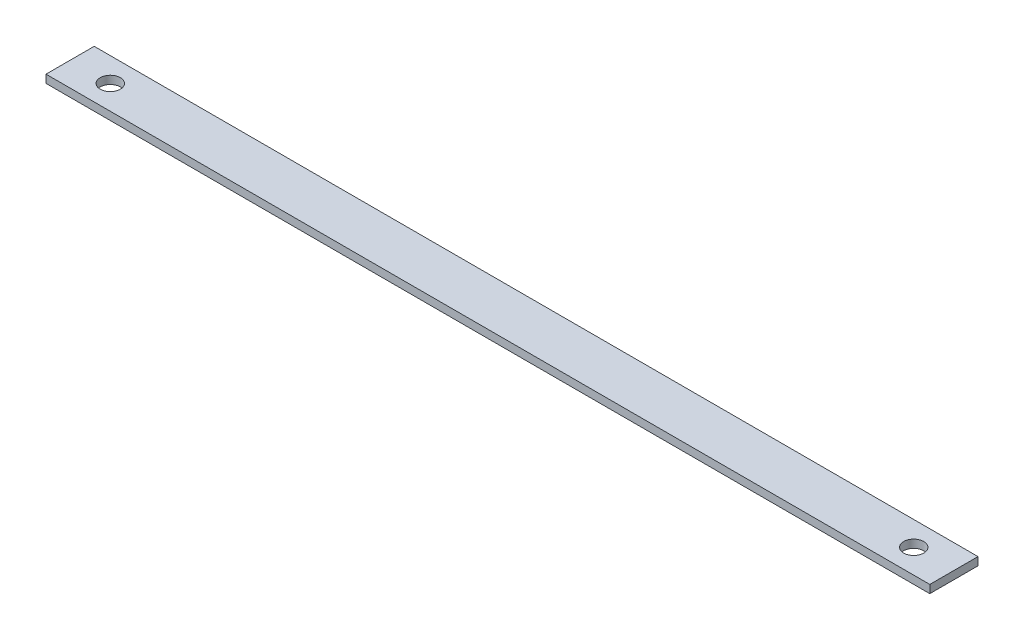
ISO-10303-21;
HEADER;
FILE_DESCRIPTION(('STEP AP214'),'2;1');
FILE_NAME('part.step','',(''),(''),'','','');
FILE_SCHEMA(('AUTOMOTIVE_DESIGN { 1 0 10303 214 1 1 1 1 }'));
ENDSEC;
DATA;
#1=APPLICATION_CONTEXT('core data for automotive mechanical design processes');
#2=APPLICATION_PROTOCOL_DEFINITION('international standard','automotive_design',2000,#1);
#3=PRODUCT_CONTEXT('',#1,'mechanical');
#4=PRODUCT('Part','Part','',(#3));
#5=PRODUCT_RELATED_PRODUCT_CATEGORY('part','',(#4));
#6=PRODUCT_DEFINITION_FORMATION('','',#4);
#7=PRODUCT_DEFINITION_CONTEXT('part definition',#1,'design');
#8=PRODUCT_DEFINITION('design','',#6,#7);
#9=PRODUCT_DEFINITION_SHAPE('','',#8);
#10=(LENGTH_UNIT() NAMED_UNIT(*) SI_UNIT(.MILLI.,.METRE.));
#11=(NAMED_UNIT(*) PLANE_ANGLE_UNIT() SI_UNIT($,.RADIAN.));
#12=(NAMED_UNIT(*) SI_UNIT($,.STERADIAN.) SOLID_ANGLE_UNIT());
#13=UNCERTAINTY_MEASURE_WITH_UNIT(LENGTH_MEASURE(1.E-05),#10,'distance_accuracy_value','');
#14=(GEOMETRIC_REPRESENTATION_CONTEXT(3) GLOBAL_UNCERTAINTY_ASSIGNED_CONTEXT((#13)) GLOBAL_UNIT_ASSIGNED_CONTEXT((#10,
#11,#12)) REPRESENTATION_CONTEXT('',''));
#15=CARTESIAN_POINT('',(0.,0.,0.));
#16=DIRECTION('',(0.,0.,1.));
#17=DIRECTION('',(1.,0.,0.));
#18=AXIS2_PLACEMENT_3D('',#15,#16,#17);
#19=CARTESIAN_POINT('',(110.,2.,6.));
#20=DIRECTION('',(-1.,0.,0.));
#21=DIRECTION('',(0.,0.,1.));
#22=AXIS2_PLACEMENT_3D('',#19,#20,#21);
#23=PLANE('',#22);
#24=DIRECTION('',(0.,0.,-1.));
#25=VECTOR('',#24,1.);
#26=CARTESIAN_POINT('',(110.,0.,6.));
#27=LINE('',#26,#25);
#28=CARTESIAN_POINT('',(110.,0.,6.));
#29=VERTEX_POINT('',#28);
#30=CARTESIAN_POINT('',(110.,0.,-6.));
#31=VERTEX_POINT('',#30);
#32=EDGE_CURVE('E96',#29,#31,#27,.T.);
#33=ORIENTED_EDGE('',*,*,#32,.T.);
#34=DIRECTION('',(0.,-1.,0.));
#35=VECTOR('',#34,1.);
#36=CARTESIAN_POINT('',(110.,2.,-6.));
#37=LINE('',#36,#35);
#38=CARTESIAN_POINT('',(110.,2.,-6.));
#39=VERTEX_POINT('',#38);
#40=EDGE_CURVE('E11',#39,#31,#37,.T.);
#41=ORIENTED_EDGE('',*,*,#40,.F.);
#42=DIRECTION('',(0.,0.,-1.));
#43=VECTOR('',#42,1.);
#44=CARTESIAN_POINT('',(110.,2.,6.));
#45=LINE('',#44,#43);
#46=CARTESIAN_POINT('',(110.,2.,6.));
#47=VERTEX_POINT('',#46);
#48=EDGE_CURVE('E84',#47,#39,#45,.T.);
#49=ORIENTED_EDGE('',*,*,#48,.F.);
#50=DIRECTION('',(0.,-1.,0.));
#51=VECTOR('',#50,1.);
#52=CARTESIAN_POINT('',(110.,2.,6.));
#53=LINE('',#52,#51);
#54=EDGE_CURVE('E92',#47,#29,#53,.T.);
#55=ORIENTED_EDGE('',*,*,#54,.T.);
#56=EDGE_LOOP('',(#33,#41,#49,#55));
#57=FACE_BOUND('',#56,.T.);
#58=ADVANCED_FACE('F33',(#57),#23,.F.);
#59=CARTESIAN_POINT('',(-110.,2.,-6.));
#60=DIRECTION('',(0.,0.,1.));
#61=DIRECTION('',(1.,0.,0.));
#62=AXIS2_PLACEMENT_3D('',#59,#60,#61);
#63=PLANE('',#62);
#64=DIRECTION('',(-1.,0.,0.));
#65=VECTOR('',#64,1.);
#66=CARTESIAN_POINT('',(-110.,0.,-6.));
#67=LINE('',#66,#65);
#68=CARTESIAN_POINT('',(-110.,0.,-6.));
#69=VERTEX_POINT('',#68);
#70=EDGE_CURVE('E88',#31,#69,#67,.T.);
#71=ORIENTED_EDGE('',*,*,#70,.T.);
#72=DIRECTION('',(0.,-1.,0.));
#73=VECTOR('',#72,1.);
#74=CARTESIAN_POINT('',(-110.,2.,-6.));
#75=LINE('',#74,#73);
#76=CARTESIAN_POINT('',(-110.,2.,-6.));
#77=VERTEX_POINT('',#76);
#78=EDGE_CURVE('E41',#77,#69,#75,.T.);
#79=ORIENTED_EDGE('',*,*,#78,.F.);
#80=DIRECTION('',(-1.,0.,0.));
#81=VECTOR('',#80,1.);
#82=CARTESIAN_POINT('',(-110.,2.,-6.));
#83=LINE('',#82,#81);
#84=EDGE_CURVE('E79',#39,#77,#83,.T.);
#85=ORIENTED_EDGE('',*,*,#84,.F.);
#86=ORIENTED_EDGE('',*,*,#40,.T.);
#87=EDGE_LOOP('',(#71,#79,#85,#86));
#88=FACE_BOUND('',#87,.T.);
#89=ADVANCED_FACE('F87',(#88),#63,.F.);
#90=CARTESIAN_POINT('',(-110.,2.,6.));
#91=DIRECTION('',(1.,0.,0.));
#92=DIRECTION('',(0.,0.,-1.));
#93=AXIS2_PLACEMENT_3D('',#90,#91,#92);
#94=PLANE('',#93);
#95=DIRECTION('',(0.,0.,1.));
#96=VECTOR('',#95,1.);
#97=CARTESIAN_POINT('',(-110.,0.,6.));
#98=LINE('',#97,#96);
#99=CARTESIAN_POINT('',(-110.,0.,6.));
#100=VERTEX_POINT('',#99);
#101=EDGE_CURVE('E66',#69,#100,#98,.T.);
#102=ORIENTED_EDGE('',*,*,#101,.T.);
#103=DIRECTION('',(0.,-1.,0.));
#104=VECTOR('',#103,1.);
#105=CARTESIAN_POINT('',(-110.,2.,6.));
#106=LINE('',#105,#104);
#107=CARTESIAN_POINT('',(-110.,2.,6.));
#108=VERTEX_POINT('',#107);
#109=EDGE_CURVE('E89',#108,#100,#106,.T.);
#110=ORIENTED_EDGE('',*,*,#109,.F.);
#111=DIRECTION('',(0.,0.,1.));
#112=VECTOR('',#111,1.);
#113=CARTESIAN_POINT('',(-110.,2.,6.));
#114=LINE('',#113,#112);
#115=EDGE_CURVE('E82',#77,#108,#114,.T.);
#116=ORIENTED_EDGE('',*,*,#115,.F.);
#117=ORIENTED_EDGE('',*,*,#78,.T.);
#118=EDGE_LOOP('',(#102,#110,#116,#117));
#119=FACE_BOUND('',#118,.T.);
#120=ADVANCED_FACE('F90',(#119),#94,.F.);
#121=CARTESIAN_POINT('',(-110.,2.,6.));
#122=DIRECTION('',(0.,0.,-1.));
#123=DIRECTION('',(-1.,0.,0.));
#124=AXIS2_PLACEMENT_3D('',#121,#122,#123);
#125=PLANE('',#124);
#126=DIRECTION('',(1.,0.,0.));
#127=VECTOR('',#126,1.);
#128=CARTESIAN_POINT('',(-110.,0.,6.));
#129=LINE('',#128,#127);
#130=EDGE_CURVE('E72',#100,#29,#129,.T.);
#131=ORIENTED_EDGE('',*,*,#130,.T.);
#132=ORIENTED_EDGE('',*,*,#54,.F.);
#133=DIRECTION('',(1.,0.,0.));
#134=VECTOR('',#133,1.);
#135=CARTESIAN_POINT('',(-110.,2.,6.));
#136=LINE('',#135,#134);
#137=EDGE_CURVE('E49',#108,#47,#136,.T.);
#138=ORIENTED_EDGE('',*,*,#137,.F.);
#139=ORIENTED_EDGE('',*,*,#109,.T.);
#140=EDGE_LOOP('',(#131,#132,#138,#139));
#141=FACE_BOUND('',#140,.T.);
#142=ADVANCED_FACE('F104',(#141),#125,.F.);
#143=CARTESIAN_POINT('',(0.,2.,0.));
#144=DIRECTION('',(0.,-1.,0.));
#145=DIRECTION('',(0.,0.,-1.));
#146=AXIS2_PLACEMENT_3D('',#143,#144,#145);
#147=PLANE('',#146);
#148=CARTESIAN_POINT('',(-100.,2.,0.));
#149=DIRECTION('',(0.,1.,0.));
#150=DIRECTION('',(0.,0.,1.));
#151=AXIS2_PLACEMENT_3D('',#148,#149,#150);
#152=CIRCLE('',#151,2.5);
#153=CARTESIAN_POINT('',(-100.,2.,2.50000000000003));
#154=VERTEX_POINT('',#153);
#155=EDGE_CURVE('E118',#154,#154,#152,.T.);
#156=ORIENTED_EDGE('',*,*,#155,.F.);
#157=EDGE_LOOP('',(#156));
#158=FACE_BOUND('',#157,.T.);
#159=CARTESIAN_POINT('',(100.,2.,0.));
#160=DIRECTION('',(0.,1.,0.));
#161=DIRECTION('',(0.,0.,1.));
#162=AXIS2_PLACEMENT_3D('',#159,#160,#161);
#163=CIRCLE('',#162,2.5);
#164=CARTESIAN_POINT('',(100.,2.,2.5));
#165=VERTEX_POINT('',#164);
#166=EDGE_CURVE('E112',#165,#165,#163,.T.);
#167=ORIENTED_EDGE('',*,*,#166,.F.);
#168=EDGE_LOOP('',(#167));
#169=FACE_BOUND('',#168,.T.);
#170=ORIENTED_EDGE('',*,*,#48,.T.);
#171=ORIENTED_EDGE('',*,*,#84,.T.);
#172=ORIENTED_EDGE('',*,*,#115,.T.);
#173=ORIENTED_EDGE('',*,*,#137,.T.);
#174=EDGE_LOOP('',(#170,#171,#172,#173));
#175=FACE_BOUND('',#174,.T.);
#176=ADVANCED_FACE('F80',(#158,#169,#175),#147,.F.);
#177=CARTESIAN_POINT('',(0.,0.,0.));
#178=DIRECTION('',(0.,-1.,0.));
#179=DIRECTION('',(0.,0.,-1.));
#180=AXIS2_PLACEMENT_3D('',#177,#178,#179);
#181=PLANE('',#180);
#182=CARTESIAN_POINT('',(-100.,0.,0.));
#183=DIRECTION('',(0.,-1.,0.));
#184=DIRECTION('',(0.,0.,-1.));
#185=AXIS2_PLACEMENT_3D('',#182,#183,#184);
#186=CIRCLE('',#185,2.5);
#187=CARTESIAN_POINT('',(-100.,0.,-2.49999999999998));
#188=VERTEX_POINT('',#187);
#189=EDGE_CURVE('E115',#188,#188,#186,.T.);
#190=ORIENTED_EDGE('',*,*,#189,.F.);
#191=EDGE_LOOP('',(#190));
#192=FACE_BOUND('',#191,.T.);
#193=CARTESIAN_POINT('',(100.,0.,0.));
#194=DIRECTION('',(0.,-1.,0.));
#195=DIRECTION('',(0.,0.,-1.));
#196=AXIS2_PLACEMENT_3D('',#193,#194,#195);
#197=CIRCLE('',#196,2.5);
#198=CARTESIAN_POINT('',(100.,0.,-2.5));
#199=VERTEX_POINT('',#198);
#200=EDGE_CURVE('E99',#199,#199,#197,.T.);
#201=ORIENTED_EDGE('',*,*,#200,.F.);
#202=EDGE_LOOP('',(#201));
#203=FACE_BOUND('',#202,.T.);
#204=ORIENTED_EDGE('',*,*,#32,.F.);
#205=ORIENTED_EDGE('',*,*,#130,.F.);
#206=ORIENTED_EDGE('',*,*,#101,.F.);
#207=ORIENTED_EDGE('',*,*,#70,.F.);
#208=EDGE_LOOP('',(#204,#205,#206,#207));
#209=FACE_BOUND('',#208,.T.);
#210=ADVANCED_FACE('F107',(#192,#203,#209),#181,.T.);
#211=CARTESIAN_POINT('',(100.,2.,0.));
#212=DIRECTION('',(0.,1.,0.));
#213=DIRECTION('',(0.,0.,1.));
#214=AXIS2_PLACEMENT_3D('',#211,#212,#213);
#215=CYLINDRICAL_SURFACE('',#214,2.5);
#216=ORIENTED_EDGE('',*,*,#166,.T.);
#217=EDGE_LOOP('',(#216));
#218=FACE_BOUND('',#217,.T.);
#219=ORIENTED_EDGE('',*,*,#200,.T.);
#220=EDGE_LOOP('',(#219));
#221=FACE_BOUND('',#220,.T.);
#222=ADVANCED_FACE('F130',(#218,#221),#215,.F.);
#223=CARTESIAN_POINT('',(-100.,2.,0.));
#224=DIRECTION('',(0.,1.,0.));
#225=DIRECTION('',(0.,0.,1.));
#226=AXIS2_PLACEMENT_3D('',#223,#224,#225);
#227=CYLINDRICAL_SURFACE('',#226,2.5);
#228=ORIENTED_EDGE('',*,*,#155,.T.);
#229=EDGE_LOOP('',(#228));
#230=FACE_BOUND('',#229,.T.);
#231=ORIENTED_EDGE('',*,*,#189,.T.);
#232=EDGE_LOOP('',(#231));
#233=FACE_BOUND('',#232,.T.);
#234=ADVANCED_FACE('F122',(#230,#233),#227,.F.);
#235=CLOSED_SHELL('',(#58,#89,#120,#142,#176,#210,#222,#234));
#236=MANIFOLD_SOLID_BREP('B2',#235);
#237=ADVANCED_BREP_SHAPE_REPRESENTATION('',(#18,#236),#14);
#238=SHAPE_DEFINITION_REPRESENTATION(#9,#237);
ENDSEC;
END-ISO-10303-21;
